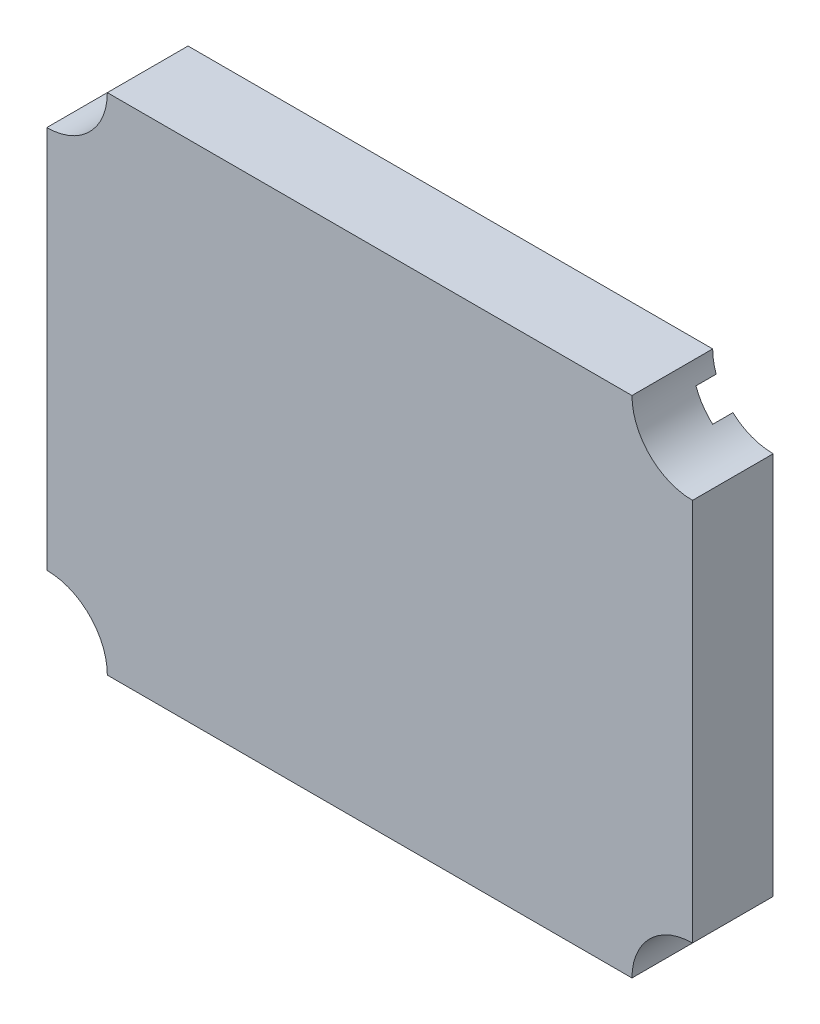
ISO-10303-21;
HEADER;
FILE_DESCRIPTION(('STEP AP214'),'2;1');
FILE_NAME('part.step','',(''),(''),'','','');
FILE_SCHEMA(('AUTOMOTIVE_DESIGN { 1 0 10303 214 1 1 1 1 }'));
ENDSEC;
DATA;
#1=APPLICATION_CONTEXT('core data for automotive mechanical design processes');
#2=APPLICATION_PROTOCOL_DEFINITION('international standard','automotive_design',2000,#1);
#3=PRODUCT_CONTEXT('',#1,'mechanical');
#4=PRODUCT('Part','Part','',(#3));
#5=PRODUCT_RELATED_PRODUCT_CATEGORY('part','',(#4));
#6=PRODUCT_DEFINITION_FORMATION('','',#4);
#7=PRODUCT_DEFINITION_CONTEXT('part definition',#1,'design');
#8=PRODUCT_DEFINITION('design','',#6,#7);
#9=PRODUCT_DEFINITION_SHAPE('','',#8);
#10=(LENGTH_UNIT() NAMED_UNIT(*) SI_UNIT(.MILLI.,.METRE.));
#11=(NAMED_UNIT(*) PLANE_ANGLE_UNIT() SI_UNIT($,.RADIAN.));
#12=(NAMED_UNIT(*) SI_UNIT($,.STERADIAN.) SOLID_ANGLE_UNIT());
#13=UNCERTAINTY_MEASURE_WITH_UNIT(LENGTH_MEASURE(1.E-05),#10,'distance_accuracy_value','');
#14=(GEOMETRIC_REPRESENTATION_CONTEXT(3) GLOBAL_UNCERTAINTY_ASSIGNED_CONTEXT((#13)) GLOBAL_UNIT_ASSIGNED_CONTEXT((#10,
#11,#12)) REPRESENTATION_CONTEXT('',''));
#15=CARTESIAN_POINT('',(0.,0.,0.));
#16=DIRECTION('',(0.,0.,1.));
#17=DIRECTION('',(1.,0.,0.));
#18=AXIS2_PLACEMENT_3D('',#15,#16,#17);
#19=CARTESIAN_POINT('',(0.,0.,0.4));
#20=DIRECTION('',(0.,0.,1.));
#21=DIRECTION('',(1.,0.,0.));
#22=AXIS2_PLACEMENT_3D('',#19,#20,#21);
#23=PLANE('',#22);
#24=CARTESIAN_POINT('',(-1.6,-1.25,0.4));
#25=DIRECTION('',(0.,0.,-1.));
#26=DIRECTION('',(1.,0.,0.));
#27=AXIS2_PLACEMENT_3D('',#24,#25,#26);
#28=CIRCLE('',#27,0.3);
#29=CARTESIAN_POINT('',(-1.6,-0.95,0.4));
#30=VERTEX_POINT('',#29);
#31=CARTESIAN_POINT('',(-1.3,-1.25,0.4));
#32=VERTEX_POINT('',#31);
#33=EDGE_CURVE('E278',#30,#32,#28,.T.);
#34=ORIENTED_EDGE('',*,*,#33,.T.);
#35=DIRECTION('',(1.,0.,0.));
#36=VECTOR('',#35,1.);
#37=CARTESIAN_POINT('',(1.6,-1.25,0.4));
#38=LINE('',#37,#36);
#39=CARTESIAN_POINT('',(1.3,-1.25,0.4));
#40=VERTEX_POINT('',#39);
#41=EDGE_CURVE('E11',#32,#40,#38,.T.);
#42=ORIENTED_EDGE('',*,*,#41,.T.);
#43=CARTESIAN_POINT('',(1.6,-1.25,0.4));
#44=DIRECTION('',(0.,0.,-1.));
#45=DIRECTION('',(1.,0.,0.));
#46=AXIS2_PLACEMENT_3D('',#43,#44,#45);
#47=CIRCLE('',#46,0.3);
#48=CARTESIAN_POINT('',(1.6,-0.95,0.4));
#49=VERTEX_POINT('',#48);
#50=EDGE_CURVE('E387',#40,#49,#47,.T.);
#51=ORIENTED_EDGE('',*,*,#50,.T.);
#52=DIRECTION('',(0.,1.,0.));
#53=VECTOR('',#52,1.);
#54=CARTESIAN_POINT('',(1.6,1.25,0.4));
#55=LINE('',#54,#53);
#56=CARTESIAN_POINT('',(1.6,0.95,0.4));
#57=VERTEX_POINT('',#56);
#58=EDGE_CURVE('E27',#49,#57,#55,.T.);
#59=ORIENTED_EDGE('',*,*,#58,.T.);
#60=CARTESIAN_POINT('',(1.6,1.25,0.4));
#61=DIRECTION('',(0.,0.,-1.));
#62=DIRECTION('',(1.,0.,0.));
#63=AXIS2_PLACEMENT_3D('',#60,#61,#62);
#64=CIRCLE('',#63,0.3);
#65=CARTESIAN_POINT('',(1.3,1.25,0.4));
#66=VERTEX_POINT('',#65);
#67=EDGE_CURVE('E183',#57,#66,#64,.T.);
#68=ORIENTED_EDGE('',*,*,#67,.T.);
#69=DIRECTION('',(-1.,0.,0.));
#70=VECTOR('',#69,1.);
#71=CARTESIAN_POINT('',(-1.6,1.25,0.4));
#72=LINE('',#71,#70);
#73=CARTESIAN_POINT('',(-1.3,1.25,0.4));
#74=VERTEX_POINT('',#73);
#75=EDGE_CURVE('E41',#66,#74,#72,.T.);
#76=ORIENTED_EDGE('',*,*,#75,.T.);
#77=CARTESIAN_POINT('',(-1.6,1.25,0.4));
#78=DIRECTION('',(0.,0.,-1.));
#79=DIRECTION('',(1.,0.,0.));
#80=AXIS2_PLACEMENT_3D('',#77,#78,#79);
#81=CIRCLE('',#80,0.3);
#82=CARTESIAN_POINT('',(-1.6,0.95,0.4));
#83=VERTEX_POINT('',#82);
#84=EDGE_CURVE('E411',#74,#83,#81,.T.);
#85=ORIENTED_EDGE('',*,*,#84,.T.);
#86=DIRECTION('',(0.,-1.,0.));
#87=VECTOR('',#86,1.);
#88=CARTESIAN_POINT('',(-1.6,-1.25,0.4));
#89=LINE('',#88,#87);
#90=EDGE_CURVE('E469',#83,#30,#89,.T.);
#91=ORIENTED_EDGE('',*,*,#90,.T.);
#92=EDGE_LOOP('',(#34,#42,#51,#59,#68,#76,#85,#91));
#93=FACE_BOUND('',#92,.T.);
#94=ADVANCED_FACE('F16',(#93),#23,.T.);
#95=CARTESIAN_POINT('',(-1.3,-1.25,0.));
#96=DIRECTION('',(0.,-1.,0.));
#97=DIRECTION('',(0.,0.,-1.));
#98=AXIS2_PLACEMENT_3D('',#95,#96,#97);
#99=PLANE('',#98);
#100=DIRECTION('',(-1.,0.,0.));
#101=VECTOR('',#100,1.);
#102=CARTESIAN_POINT('',(1.6,-1.25,0.));
#103=LINE('',#102,#101);
#104=CARTESIAN_POINT('',(1.3,-1.25,0.));
#105=VERTEX_POINT('',#104);
#106=CARTESIAN_POINT('',(-1.3,-1.25,0.));
#107=VERTEX_POINT('',#106);
#108=EDGE_CURVE('E297',#105,#107,#103,.T.);
#109=ORIENTED_EDGE('',*,*,#108,.F.);
#110=DIRECTION('',(0.,0.,1.));
#111=VECTOR('',#110,1.);
#112=CARTESIAN_POINT('',(1.3,-1.25,0.));
#113=LINE('',#112,#111);
#114=EDGE_CURVE('E390',#105,#40,#113,.T.);
#115=ORIENTED_EDGE('',*,*,#114,.T.);
#116=ORIENTED_EDGE('',*,*,#41,.F.);
#117=DIRECTION('',(0.,0.,1.));
#118=VECTOR('',#117,1.);
#119=CARTESIAN_POINT('',(-1.3,-1.25,0.));
#120=LINE('',#119,#118);
#121=EDGE_CURVE('E292',#107,#32,#120,.T.);
#122=ORIENTED_EDGE('',*,*,#121,.F.);
#123=EDGE_LOOP('',(#109,#115,#116,#122));
#124=FACE_BOUND('',#123,.T.);
#125=ADVANCED_FACE('F678',(#124),#99,.T.);
#126=CARTESIAN_POINT('',(1.6,-0.95,0.));
#127=DIRECTION('',(1.,0.,0.));
#128=DIRECTION('',(0.,1.,0.));
#129=AXIS2_PLACEMENT_3D('',#126,#127,#128);
#130=PLANE('',#129);
#131=DIRECTION('',(0.,-1.,0.));
#132=VECTOR('',#131,1.);
#133=CARTESIAN_POINT('',(1.6,1.25,0.));
#134=LINE('',#133,#132);
#135=CARTESIAN_POINT('',(1.6,0.95,0.));
#136=VERTEX_POINT('',#135);
#137=CARTESIAN_POINT('',(1.6,-0.95,0.));
#138=VERTEX_POINT('',#137);
#139=EDGE_CURVE('E225',#136,#138,#134,.T.);
#140=ORIENTED_EDGE('',*,*,#139,.F.);
#141=DIRECTION('',(0.,0.,1.));
#142=VECTOR('',#141,1.);
#143=CARTESIAN_POINT('',(1.6,0.95,0.));
#144=LINE('',#143,#142);
#145=EDGE_CURVE('E255',#136,#57,#144,.T.);
#146=ORIENTED_EDGE('',*,*,#145,.T.);
#147=ORIENTED_EDGE('',*,*,#58,.F.);
#148=DIRECTION('',(0.,0.,1.));
#149=VECTOR('',#148,1.);
#150=CARTESIAN_POINT('',(1.6,-0.95,0.));
#151=LINE('',#150,#149);
#152=EDGE_CURVE('E391',#138,#49,#151,.T.);
#153=ORIENTED_EDGE('',*,*,#152,.F.);
#154=EDGE_LOOP('',(#140,#146,#147,#153));
#155=FACE_BOUND('',#154,.T.);
#156=ADVANCED_FACE('F673',(#155),#130,.T.);
#157=CARTESIAN_POINT('',(1.3,1.25,0.));
#158=DIRECTION('',(0.,1.,0.));
#159=DIRECTION('',(1.,0.,0.));
#160=AXIS2_PLACEMENT_3D('',#157,#158,#159);
#161=PLANE('',#160);
#162=DIRECTION('',(1.,0.,0.));
#163=VECTOR('',#162,1.);
#164=CARTESIAN_POINT('',(-1.6,1.25,0.));
#165=LINE('',#164,#163);
#166=CARTESIAN_POINT('',(-1.3,1.25,0.));
#167=VERTEX_POINT('',#166);
#168=CARTESIAN_POINT('',(1.3,1.25,0.));
#169=VERTEX_POINT('',#168);
#170=EDGE_CURVE('E177',#167,#169,#165,.T.);
#171=ORIENTED_EDGE('',*,*,#170,.F.);
#172=DIRECTION('',(0.,0.,1.));
#173=VECTOR('',#172,1.);
#174=CARTESIAN_POINT('',(-1.3,1.25,0.));
#175=LINE('',#174,#173);
#176=EDGE_CURVE('E414',#167,#74,#175,.T.);
#177=ORIENTED_EDGE('',*,*,#176,.T.);
#178=ORIENTED_EDGE('',*,*,#75,.F.);
#179=DIRECTION('',(0.,0.,1.));
#180=VECTOR('',#179,1.);
#181=CARTESIAN_POINT('',(1.3,1.25,0.));
#182=LINE('',#181,#180);
#183=EDGE_CURVE('E173',#169,#66,#182,.T.);
#184=ORIENTED_EDGE('',*,*,#183,.F.);
#185=EDGE_LOOP('',(#171,#177,#178,#184));
#186=FACE_BOUND('',#185,.T.);
#187=ADVANCED_FACE('F175',(#186),#161,.T.);
#188=CARTESIAN_POINT('',(-1.6,0.95,0.));
#189=DIRECTION('',(-1.,0.,0.));
#190=DIRECTION('',(0.,0.,1.));
#191=AXIS2_PLACEMENT_3D('',#188,#189,#190);
#192=PLANE('',#191);
#193=DIRECTION('',(0.,1.,0.));
#194=VECTOR('',#193,1.);
#195=CARTESIAN_POINT('',(-1.6,-1.25,0.));
#196=LINE('',#195,#194);
#197=CARTESIAN_POINT('',(-1.6,-0.95,0.));
#198=VERTEX_POINT('',#197);
#199=CARTESIAN_POINT('',(-1.6,0.95,0.));
#200=VERTEX_POINT('',#199);
#201=EDGE_CURVE('E20',#198,#200,#196,.T.);
#202=ORIENTED_EDGE('',*,*,#201,.F.);
#203=DIRECTION('',(0.,0.,1.));
#204=VECTOR('',#203,1.);
#205=CARTESIAN_POINT('',(-1.6,-0.95,0.));
#206=LINE('',#205,#204);
#207=EDGE_CURVE('E274',#198,#30,#206,.T.);
#208=ORIENTED_EDGE('',*,*,#207,.T.);
#209=ORIENTED_EDGE('',*,*,#90,.F.);
#210=DIRECTION('',(0.,0.,1.));
#211=VECTOR('',#210,1.);
#212=CARTESIAN_POINT('',(-1.6,0.95,0.));
#213=LINE('',#212,#211);
#214=EDGE_CURVE('E251',#200,#83,#213,.T.);
#215=ORIENTED_EDGE('',*,*,#214,.F.);
#216=EDGE_LOOP('',(#202,#208,#209,#215));
#217=FACE_BOUND('',#216,.T.);
#218=ADVANCED_FACE('F728',(#217),#192,.T.);
#219=CARTESIAN_POINT('',(-1.6,1.25,0.));
#220=DIRECTION('',(0.,0.,1.));
#221=DIRECTION('',(1.,0.,0.));
#222=AXIS2_PLACEMENT_3D('',#219,#220,#221);
#223=CYLINDRICAL_SURFACE('',#222,0.3);
#224=ORIENTED_EDGE('',*,*,#214,.T.);
#225=ORIENTED_EDGE('',*,*,#84,.F.);
#226=ORIENTED_EDGE('',*,*,#176,.F.);
#227=CARTESIAN_POINT('',(-1.6,1.25,0.));
#228=DIRECTION('',(0.,0.,1.));
#229=DIRECTION('',(1.,0.,0.));
#230=AXIS2_PLACEMENT_3D('',#227,#228,#229);
#231=CIRCLE('',#230,0.3);
#232=CARTESIAN_POINT('',(-1.31715728752538,1.15,0.));
#233=VERTEX_POINT('',#232);
#234=EDGE_CURVE('E202',#233,#167,#231,.T.);
#235=ORIENTED_EDGE('',*,*,#234,.F.);
#236=DIRECTION('',(0.,0.,1.));
#237=VECTOR('',#236,1.);
#238=CARTESIAN_POINT('',(-1.31715728752538,1.15,0.));
#239=LINE('',#238,#237);
#240=CARTESIAN_POINT('',(-1.31715728752538,1.15,0.1));
#241=VERTEX_POINT('',#240);
#242=EDGE_CURVE('E240',#233,#241,#239,.T.);
#243=ORIENTED_EDGE('',*,*,#242,.T.);
#244=CARTESIAN_POINT('',(-1.6,1.25,0.1));
#245=DIRECTION('',(0.,0.,-1.));
#246=DIRECTION('',(1.,0.,0.));
#247=AXIS2_PLACEMENT_3D('',#244,#245,#246);
#248=CIRCLE('',#247,0.3);
#249=CARTESIAN_POINT('',(-1.4,1.02639320225002,0.1));
#250=VERTEX_POINT('',#249);
#251=EDGE_CURVE('E247',#241,#250,#248,.T.);
#252=ORIENTED_EDGE('',*,*,#251,.T.);
#253=DIRECTION('',(0.,0.,-1.));
#254=VECTOR('',#253,1.);
#255=CARTESIAN_POINT('',(-1.4,1.02639320225002,0.));
#256=LINE('',#255,#254);
#257=CARTESIAN_POINT('',(-1.4,1.02639320225002,0.));
#258=VERTEX_POINT('',#257);
#259=EDGE_CURVE('E236',#250,#258,#256,.T.);
#260=ORIENTED_EDGE('',*,*,#259,.T.);
#261=CARTESIAN_POINT('',(-1.6,1.25,0.));
#262=DIRECTION('',(0.,0.,1.));
#263=DIRECTION('',(1.,0.,0.));
#264=AXIS2_PLACEMENT_3D('',#261,#262,#263);
#265=CIRCLE('',#264,0.3);
#266=EDGE_CURVE('E316',#200,#258,#265,.T.);
#267=ORIENTED_EDGE('',*,*,#266,.F.);
#268=EDGE_LOOP('',(#224,#225,#226,#235,#243,#252,#260,#267));
#269=FACE_BOUND('',#268,.T.);
#270=ADVANCED_FACE('F666',(#269),#223,.F.);
#271=CARTESIAN_POINT('',(-0.9,0.73125,0.1));
#272=DIRECTION('',(0.,0.,1.));
#273=DIRECTION('',(1.,0.,0.));
#274=AXIS2_PLACEMENT_3D('',#271,#272,#273);
#275=PLANE('',#274);
#276=DIRECTION('',(-1.,0.,0.));
#277=VECTOR('',#276,1.);
#278=CARTESIAN_POINT('',(-0.4,1.15,0.1));
#279=LINE('',#278,#277);
#280=CARTESIAN_POINT('',(-0.4,1.15,0.1));
#281=VERTEX_POINT('',#280);
#282=EDGE_CURVE('E235',#281,#241,#279,.T.);
#283=ORIENTED_EDGE('',*,*,#282,.F.);
#284=DIRECTION('',(0.,1.,0.));
#285=VECTOR('',#284,1.);
#286=CARTESIAN_POINT('',(-0.4,0.3125,0.1));
#287=LINE('',#286,#285);
#288=CARTESIAN_POINT('',(-0.4,0.3125,0.1));
#289=VERTEX_POINT('',#288);
#290=EDGE_CURVE('E306',#289,#281,#287,.T.);
#291=ORIENTED_EDGE('',*,*,#290,.F.);
#292=DIRECTION('',(1.,0.,0.));
#293=VECTOR('',#292,1.);
#294=CARTESIAN_POINT('',(-0.4,0.3125,0.1));
#295=LINE('',#294,#293);
#296=CARTESIAN_POINT('',(-1.4,0.3125,0.1));
#297=VERTEX_POINT('',#296);
#298=EDGE_CURVE('E315',#297,#289,#295,.T.);
#299=ORIENTED_EDGE('',*,*,#298,.F.);
#300=DIRECTION('',(0.,-1.,0.));
#301=VECTOR('',#300,1.);
#302=CARTESIAN_POINT('',(-1.4,0.3125,0.1));
#303=LINE('',#302,#301);
#304=EDGE_CURVE('E231',#250,#297,#303,.T.);
#305=ORIENTED_EDGE('',*,*,#304,.F.);
#306=ORIENTED_EDGE('',*,*,#251,.F.);
#307=EDGE_LOOP('',(#283,#291,#299,#305,#306));
#308=FACE_BOUND('',#307,.T.);
#309=ADVANCED_FACE('F661',(#308),#275,.F.);
#310=CARTESIAN_POINT('',(-0.4,1.15,0.));
#311=DIRECTION('',(0.,1.,0.));
#312=DIRECTION('',(1.,0.,0.));
#313=AXIS2_PLACEMENT_3D('',#310,#311,#312);
#314=PLANE('',#313);
#315=DIRECTION('',(-1.,0.,0.));
#316=VECTOR('',#315,1.);
#317=CARTESIAN_POINT('',(-0.2,1.15,0.));
#318=LINE('',#317,#316);
#319=CARTESIAN_POINT('',(-0.4,1.15,0.));
#320=VERTEX_POINT('',#319);
#321=EDGE_CURVE('E209',#320,#233,#318,.T.);
#322=ORIENTED_EDGE('',*,*,#321,.F.);
#323=DIRECTION('',(0.,0.,1.));
#324=VECTOR('',#323,1.);
#325=CARTESIAN_POINT('',(-0.4,1.15,0.));
#326=LINE('',#325,#324);
#327=EDGE_CURVE('E310',#320,#281,#326,.T.);
#328=ORIENTED_EDGE('',*,*,#327,.T.);
#329=ORIENTED_EDGE('',*,*,#282,.T.);
#330=ORIENTED_EDGE('',*,*,#242,.F.);
#331=EDGE_LOOP('',(#322,#328,#329,#330));
#332=FACE_BOUND('',#331,.T.);
#333=ADVANCED_FACE('F18',(#332),#314,.F.);
#334=CARTESIAN_POINT('',(-1.4,1.02639320225002,0.));
#335=DIRECTION('',(-1.,0.,0.));
#336=DIRECTION('',(0.,0.,1.));
#337=AXIS2_PLACEMENT_3D('',#334,#335,#336);
#338=PLANE('',#337);
#339=DIRECTION('',(0.,-1.,0.));
#340=VECTOR('',#339,1.);
#341=CARTESIAN_POINT('',(-1.4,0.513196601125011,0.));
#342=LINE('',#341,#340);
#343=CARTESIAN_POINT('',(-1.4,0.3125,0.));
#344=VERTEX_POINT('',#343);
#345=EDGE_CURVE('E320',#258,#344,#342,.T.);
#346=ORIENTED_EDGE('',*,*,#345,.F.);
#347=ORIENTED_EDGE('',*,*,#259,.F.);
#348=ORIENTED_EDGE('',*,*,#304,.T.);
#349=DIRECTION('',(0.,0.,1.));
#350=VECTOR('',#349,1.);
#351=CARTESIAN_POINT('',(-1.4,0.3125,0.));
#352=LINE('',#351,#350);
#353=EDGE_CURVE('E311',#344,#297,#352,.T.);
#354=ORIENTED_EDGE('',*,*,#353,.F.);
#355=EDGE_LOOP('',(#346,#347,#348,#354));
#356=FACE_BOUND('',#355,.T.);
#357=ADVANCED_FACE('F740',(#356),#338,.F.);
#358=CARTESIAN_POINT('',(-1.4,0.3125,0.));
#359=DIRECTION('',(0.,-1.,0.));
#360=DIRECTION('',(0.,0.,-1.));
#361=AXIS2_PLACEMENT_3D('',#358,#359,#360);
#362=PLANE('',#361);
#363=DIRECTION('',(1.,0.,0.));
#364=VECTOR('',#363,1.);
#365=CARTESIAN_POINT('',(-0.7,0.3125,0.));
#366=LINE('',#365,#364);
#367=CARTESIAN_POINT('',(-0.4,0.3125,0.));
#368=VERTEX_POINT('',#367);
#369=EDGE_CURVE('E329',#344,#368,#366,.T.);
#370=ORIENTED_EDGE('',*,*,#369,.F.);
#371=ORIENTED_EDGE('',*,*,#353,.T.);
#372=ORIENTED_EDGE('',*,*,#298,.T.);
#373=DIRECTION('',(0.,0.,1.));
#374=VECTOR('',#373,1.);
#375=CARTESIAN_POINT('',(-0.4,0.3125,0.));
#376=LINE('',#375,#374);
#377=EDGE_CURVE('E259',#368,#289,#376,.T.);
#378=ORIENTED_EDGE('',*,*,#377,.F.);
#379=EDGE_LOOP('',(#370,#371,#372,#378));
#380=FACE_BOUND('',#379,.T.);
#381=ADVANCED_FACE('F745',(#380),#362,.F.);
#382=CARTESIAN_POINT('',(-0.4,0.3125,0.));
#383=DIRECTION('',(1.,0.,0.));
#384=DIRECTION('',(0.,1.,0.));
#385=AXIS2_PLACEMENT_3D('',#382,#383,#384);
#386=PLANE('',#385);
#387=DIRECTION('',(0.,1.,0.));
#388=VECTOR('',#387,1.);
#389=CARTESIAN_POINT('',(-0.4,0.15625,0.));
#390=LINE('',#389,#388);
#391=EDGE_CURVE('E449',#368,#320,#390,.T.);
#392=ORIENTED_EDGE('',*,*,#391,.F.);
#393=ORIENTED_EDGE('',*,*,#377,.T.);
#394=ORIENTED_EDGE('',*,*,#290,.T.);
#395=ORIENTED_EDGE('',*,*,#327,.F.);
#396=EDGE_LOOP('',(#392,#393,#394,#395));
#397=FACE_BOUND('',#396,.T.);
#398=ADVANCED_FACE('F766',(#397),#386,.F.);
#399=CARTESIAN_POINT('',(1.6,1.25,0.));
#400=DIRECTION('',(0.,0.,1.));
#401=DIRECTION('',(1.,0.,0.));
#402=AXIS2_PLACEMENT_3D('',#399,#400,#401);
#403=CYLINDRICAL_SURFACE('',#402,0.3);
#404=ORIENTED_EDGE('',*,*,#183,.T.);
#405=ORIENTED_EDGE('',*,*,#67,.F.);
#406=ORIENTED_EDGE('',*,*,#145,.F.);
#407=CARTESIAN_POINT('',(1.6,1.25,0.));
#408=DIRECTION('',(0.,0.,1.));
#409=DIRECTION('',(1.,0.,0.));
#410=AXIS2_PLACEMENT_3D('',#407,#408,#409);
#411=CIRCLE('',#410,0.3);
#412=CARTESIAN_POINT('',(1.4,1.02639320225002,0.));
#413=VERTEX_POINT('',#412);
#414=EDGE_CURVE('E221',#413,#136,#411,.T.);
#415=ORIENTED_EDGE('',*,*,#414,.F.);
#416=DIRECTION('',(0.,0.,1.));
#417=VECTOR('',#416,1.);
#418=CARTESIAN_POINT('',(1.4,1.02639320225002,0.));
#419=LINE('',#418,#417);
#420=CARTESIAN_POINT('',(1.4,1.02639320225002,0.1));
#421=VERTEX_POINT('',#420);
#422=EDGE_CURVE('E288',#413,#421,#419,.T.);
#423=ORIENTED_EDGE('',*,*,#422,.T.);
#424=CARTESIAN_POINT('',(1.6,1.25,0.1));
#425=DIRECTION('',(0.,0.,-1.));
#426=DIRECTION('',(1.,0.,0.));
#427=AXIS2_PLACEMENT_3D('',#424,#425,#426);
#428=CIRCLE('',#427,0.3);
#429=CARTESIAN_POINT('',(1.31715728752538,1.15,0.1));
#430=VERTEX_POINT('',#429);
#431=EDGE_CURVE('E184',#421,#430,#428,.T.);
#432=ORIENTED_EDGE('',*,*,#431,.T.);
#433=DIRECTION('',(0.,0.,-1.));
#434=VECTOR('',#433,1.);
#435=CARTESIAN_POINT('',(1.31715728752538,1.15,0.));
#436=LINE('',#435,#434);
#437=CARTESIAN_POINT('',(1.31715728752538,1.15,0.));
#438=VERTEX_POINT('',#437);
#439=EDGE_CURVE('E191',#430,#438,#436,.T.);
#440=ORIENTED_EDGE('',*,*,#439,.T.);
#441=CARTESIAN_POINT('',(1.6,1.25,0.));
#442=DIRECTION('',(0.,0.,1.));
#443=DIRECTION('',(1.,0.,0.));
#444=AXIS2_PLACEMENT_3D('',#441,#442,#443);
#445=CIRCLE('',#444,0.3);
#446=EDGE_CURVE('E187',#169,#438,#445,.T.);
#447=ORIENTED_EDGE('',*,*,#446,.F.);
#448=EDGE_LOOP('',(#404,#405,#406,#415,#423,#432,#440,#447));
#449=FACE_BOUND('',#448,.T.);
#450=ADVANCED_FACE('F188',(#449),#403,.F.);
#451=CARTESIAN_POINT('',(0.9,0.73125,0.1));
#452=DIRECTION('',(0.,0.,1.));
#453=DIRECTION('',(1.,0.,0.));
#454=AXIS2_PLACEMENT_3D('',#451,#452,#453);
#455=PLANE('',#454);
#456=DIRECTION('',(1.,0.,0.));
#457=VECTOR('',#456,1.);
#458=CARTESIAN_POINT('',(0.4,0.3125,0.1));
#459=LINE('',#458,#457);
#460=CARTESIAN_POINT('',(0.4,0.3125,0.1));
#461=VERTEX_POINT('',#460);
#462=CARTESIAN_POINT('',(1.4,0.3125,0.1));
#463=VERTEX_POINT('',#462);
#464=EDGE_CURVE('E284',#461,#463,#459,.T.);
#465=ORIENTED_EDGE('',*,*,#464,.F.);
#466=DIRECTION('',(0.,-1.,0.));
#467=VECTOR('',#466,1.);
#468=CARTESIAN_POINT('',(0.4,0.3125,0.1));
#469=LINE('',#468,#467);
#470=CARTESIAN_POINT('',(0.4,1.15,0.1));
#471=VERTEX_POINT('',#470);
#472=EDGE_CURVE('E266',#471,#461,#469,.T.);
#473=ORIENTED_EDGE('',*,*,#472,.F.);
#474=DIRECTION('',(-1.,0.,0.));
#475=VECTOR('',#474,1.);
#476=CARTESIAN_POINT('',(0.4,1.15,0.1));
#477=LINE('',#476,#475);
#478=EDGE_CURVE('E465',#430,#471,#477,.T.);
#479=ORIENTED_EDGE('',*,*,#478,.F.);
#480=ORIENTED_EDGE('',*,*,#431,.F.);
#481=DIRECTION('',(0.,1.,0.));
#482=VECTOR('',#481,1.);
#483=CARTESIAN_POINT('',(1.4,0.3125,0.1));
#484=LINE('',#483,#482);
#485=EDGE_CURVE('E321',#463,#421,#484,.T.);
#486=ORIENTED_EDGE('',*,*,#485,.F.);
#487=EDGE_LOOP('',(#465,#473,#479,#480,#486));
#488=FACE_BOUND('',#487,.T.);
#489=ADVANCED_FACE('F788',(#488),#455,.F.);
#490=CARTESIAN_POINT('',(0.4,0.3125,0.));
#491=DIRECTION('',(0.,-1.,0.));
#492=DIRECTION('',(0.,0.,-1.));
#493=AXIS2_PLACEMENT_3D('',#490,#491,#492);
#494=PLANE('',#493);
#495=DIRECTION('',(1.,0.,0.));
#496=VECTOR('',#495,1.);
#497=CARTESIAN_POINT('',(0.2,0.3125,0.));
#498=LINE('',#497,#496);
#499=CARTESIAN_POINT('',(0.4,0.3125,0.));
#500=VERTEX_POINT('',#499);
#501=CARTESIAN_POINT('',(1.4,0.3125,0.));
#502=VERTEX_POINT('',#501);
#503=EDGE_CURVE('E230',#500,#502,#498,.T.);
#504=ORIENTED_EDGE('',*,*,#503,.F.);
#505=DIRECTION('',(0.,0.,1.));
#506=VECTOR('',#505,1.);
#507=CARTESIAN_POINT('',(0.4,0.3125,0.));
#508=LINE('',#507,#506);
#509=EDGE_CURVE('E270',#500,#461,#508,.T.);
#510=ORIENTED_EDGE('',*,*,#509,.T.);
#511=ORIENTED_EDGE('',*,*,#464,.T.);
#512=DIRECTION('',(0.,0.,1.));
#513=VECTOR('',#512,1.);
#514=CARTESIAN_POINT('',(1.4,0.3125,0.));
#515=LINE('',#514,#513);
#516=EDGE_CURVE('E325',#502,#463,#515,.T.);
#517=ORIENTED_EDGE('',*,*,#516,.F.);
#518=EDGE_LOOP('',(#504,#510,#511,#517));
#519=FACE_BOUND('',#518,.T.);
#520=ADVANCED_FACE('F782',(#519),#494,.F.);
#521=CARTESIAN_POINT('',(1.4,0.3125,0.));
#522=DIRECTION('',(1.,0.,0.));
#523=DIRECTION('',(0.,1.,0.));
#524=AXIS2_PLACEMENT_3D('',#521,#522,#523);
#525=PLANE('',#524);
#526=DIRECTION('',(0.,1.,0.));
#527=VECTOR('',#526,1.);
#528=CARTESIAN_POINT('',(1.4,0.15625,0.));
#529=LINE('',#528,#527);
#530=EDGE_CURVE('E226',#502,#413,#529,.T.);
#531=ORIENTED_EDGE('',*,*,#530,.F.);
#532=ORIENTED_EDGE('',*,*,#516,.T.);
#533=ORIENTED_EDGE('',*,*,#485,.T.);
#534=ORIENTED_EDGE('',*,*,#422,.F.);
#535=EDGE_LOOP('',(#531,#532,#533,#534));
#536=FACE_BOUND('',#535,.T.);
#537=ADVANCED_FACE('F787',(#536),#525,.F.);
#538=CARTESIAN_POINT('',(1.31715728752538,1.15,0.));
#539=DIRECTION('',(0.,1.,0.));
#540=DIRECTION('',(1.,0.,0.));
#541=AXIS2_PLACEMENT_3D('',#538,#539,#540);
#542=PLANE('',#541);
#543=DIRECTION('',(-1.,0.,0.));
#544=VECTOR('',#543,1.);
#545=CARTESIAN_POINT('',(0.658578643762691,1.15,0.));
#546=LINE('',#545,#544);
#547=CARTESIAN_POINT('',(0.4,1.15,0.));
#548=VERTEX_POINT('',#547);
#549=EDGE_CURVE('E196',#438,#548,#546,.T.);
#550=ORIENTED_EDGE('',*,*,#549,.F.);
#551=ORIENTED_EDGE('',*,*,#439,.F.);
#552=ORIENTED_EDGE('',*,*,#478,.T.);
#553=DIRECTION('',(0.,0.,1.));
#554=VECTOR('',#553,1.);
#555=CARTESIAN_POINT('',(0.4,1.15,0.));
#556=LINE('',#555,#554);
#557=EDGE_CURVE('E271',#548,#471,#556,.T.);
#558=ORIENTED_EDGE('',*,*,#557,.F.);
#559=EDGE_LOOP('',(#550,#551,#552,#558));
#560=FACE_BOUND('',#559,.T.);
#561=ADVANCED_FACE('F754',(#560),#542,.F.);
#562=CARTESIAN_POINT('',(0.4,1.15,0.));
#563=DIRECTION('',(-1.,0.,0.));
#564=DIRECTION('',(0.,0.,1.));
#565=AXIS2_PLACEMENT_3D('',#562,#563,#564);
#566=PLANE('',#565);
#567=DIRECTION('',(0.,-1.,0.));
#568=VECTOR('',#567,1.);
#569=CARTESIAN_POINT('',(0.4,0.575,0.));
#570=LINE('',#569,#568);
#571=EDGE_CURVE('E298',#548,#500,#570,.T.);
#572=ORIENTED_EDGE('',*,*,#571,.F.);
#573=ORIENTED_EDGE('',*,*,#557,.T.);
#574=ORIENTED_EDGE('',*,*,#472,.T.);
#575=ORIENTED_EDGE('',*,*,#509,.F.);
#576=EDGE_LOOP('',(#572,#573,#574,#575));
#577=FACE_BOUND('',#576,.T.);
#578=ADVANCED_FACE('F688',(#577),#566,.F.);
#579=CARTESIAN_POINT('',(1.6,-1.25,0.));
#580=DIRECTION('',(0.,0.,1.));
#581=DIRECTION('',(1.,0.,0.));
#582=AXIS2_PLACEMENT_3D('',#579,#580,#581);
#583=CYLINDRICAL_SURFACE('',#582,0.3);
#584=ORIENTED_EDGE('',*,*,#152,.T.);
#585=ORIENTED_EDGE('',*,*,#50,.F.);
#586=ORIENTED_EDGE('',*,*,#114,.F.);
#587=CARTESIAN_POINT('',(1.6,-1.25,0.));
#588=DIRECTION('',(0.,0.,1.));
#589=DIRECTION('',(1.,0.,0.));
#590=AXIS2_PLACEMENT_3D('',#587,#588,#589);
#591=CIRCLE('',#590,0.3);
#592=CARTESIAN_POINT('',(1.31715728752538,-1.15,0.));
#593=VERTEX_POINT('',#592);
#594=EDGE_CURVE('E293',#593,#105,#591,.T.);
#595=ORIENTED_EDGE('',*,*,#594,.F.);
#596=DIRECTION('',(0.,0.,1.));
#597=VECTOR('',#596,1.);
#598=CARTESIAN_POINT('',(1.31715728752538,-1.15,0.));
#599=LINE('',#598,#597);
#600=CARTESIAN_POINT('',(1.31715728752538,-1.15,0.1));
#601=VERTEX_POINT('',#600);
#602=EDGE_CURVE('E264',#593,#601,#599,.T.);
#603=ORIENTED_EDGE('',*,*,#602,.T.);
#604=CARTESIAN_POINT('',(1.6,-1.25,0.1));
#605=DIRECTION('',(0.,0.,-1.));
#606=DIRECTION('',(1.,0.,0.));
#607=AXIS2_PLACEMENT_3D('',#604,#605,#606);
#608=CIRCLE('',#607,0.3);
#609=CARTESIAN_POINT('',(1.4,-1.02639320225002,0.1));
#610=VERTEX_POINT('',#609);
#611=EDGE_CURVE('E386',#601,#610,#608,.T.);
#612=ORIENTED_EDGE('',*,*,#611,.T.);
#613=DIRECTION('',(0.,0.,-1.));
#614=VECTOR('',#613,1.);
#615=CARTESIAN_POINT('',(1.4,-1.02639320225002,0.));
#616=LINE('',#615,#614);
#617=CARTESIAN_POINT('',(1.4,-1.02639320225002,0.));
#618=VERTEX_POINT('',#617);
#619=EDGE_CURVE('E336',#610,#618,#616,.T.);
#620=ORIENTED_EDGE('',*,*,#619,.T.);
#621=CARTESIAN_POINT('',(1.6,-1.25,0.));
#622=DIRECTION('',(0.,0.,1.));
#623=DIRECTION('',(1.,0.,0.));
#624=AXIS2_PLACEMENT_3D('',#621,#622,#623);
#625=CIRCLE('',#624,0.3);
#626=EDGE_CURVE('E378',#138,#618,#625,.T.);
#627=ORIENTED_EDGE('',*,*,#626,.F.);
#628=EDGE_LOOP('',(#584,#585,#586,#595,#603,#612,#620,#627));
#629=FACE_BOUND('',#628,.T.);
#630=ADVANCED_FACE('F492',(#629),#583,.F.);
#631=CARTESIAN_POINT('',(0.9,-0.73125,0.1));
#632=DIRECTION('',(0.,0.,1.));
#633=DIRECTION('',(1.,0.,0.));
#634=AXIS2_PLACEMENT_3D('',#631,#632,#633);
#635=PLANE('',#634);
#636=DIRECTION('',(0.,-1.,0.));
#637=VECTOR('',#636,1.);
#638=CARTESIAN_POINT('',(0.4,-0.3125,0.1));
#639=LINE('',#638,#637);
#640=CARTESIAN_POINT('',(0.4,-0.3125,0.1));
#641=VERTEX_POINT('',#640);
#642=CARTESIAN_POINT('',(0.4,-1.15,0.1));
#643=VERTEX_POINT('',#642);
#644=EDGE_CURVE('E384',#641,#643,#639,.T.);
#645=ORIENTED_EDGE('',*,*,#644,.F.);
#646=DIRECTION('',(-1.,0.,0.));
#647=VECTOR('',#646,1.);
#648=CARTESIAN_POINT('',(0.4,-0.3125,0.1));
#649=LINE('',#648,#647);
#650=CARTESIAN_POINT('',(1.4,-0.3125,0.1));
#651=VERTEX_POINT('',#650);
#652=EDGE_CURVE('E357',#651,#641,#649,.T.);
#653=ORIENTED_EDGE('',*,*,#652,.F.);
#654=DIRECTION('',(0.,1.,0.));
#655=VECTOR('',#654,1.);
#656=CARTESIAN_POINT('',(1.4,-0.3125,0.1));
#657=LINE('',#656,#655);
#658=EDGE_CURVE('E333',#610,#651,#657,.T.);
#659=ORIENTED_EDGE('',*,*,#658,.F.);
#660=ORIENTED_EDGE('',*,*,#611,.F.);
#661=DIRECTION('',(1.,0.,0.));
#662=VECTOR('',#661,1.);
#663=CARTESIAN_POINT('',(0.4,-1.15,0.1));
#664=LINE('',#663,#662);
#665=EDGE_CURVE('E260',#643,#601,#664,.T.);
#666=ORIENTED_EDGE('',*,*,#665,.F.);
#667=EDGE_LOOP('',(#645,#653,#659,#660,#666));
#668=FACE_BOUND('',#667,.T.);
#669=ADVANCED_FACE('F574',(#668),#635,.F.);
#670=CARTESIAN_POINT('',(0.4,-0.3125,0.));
#671=DIRECTION('',(-1.,0.,0.));
#672=DIRECTION('',(0.,1.,0.));
#673=AXIS2_PLACEMENT_3D('',#670,#671,#672);
#674=PLANE('',#673);
#675=DIRECTION('',(0.,-1.,0.));
#676=VECTOR('',#675,1.);
#677=CARTESIAN_POINT('',(0.4,-0.15625,0.));
#678=LINE('',#677,#676);
#679=CARTESIAN_POINT('',(0.4,-0.3125,0.));
#680=VERTEX_POINT('',#679);
#681=CARTESIAN_POINT('',(0.4,-1.15,0.));
#682=VERTEX_POINT('',#681);
#683=EDGE_CURVE('E241',#680,#682,#678,.T.);
#684=ORIENTED_EDGE('',*,*,#683,.F.);
#685=DIRECTION('',(0.,0.,1.));
#686=VECTOR('',#685,1.);
#687=CARTESIAN_POINT('',(0.4,-0.3125,0.));
#688=LINE('',#687,#686);
#689=EDGE_CURVE('E353',#680,#641,#688,.T.);
#690=ORIENTED_EDGE('',*,*,#689,.T.);
#691=ORIENTED_EDGE('',*,*,#644,.T.);
#692=DIRECTION('',(0.,0.,1.));
#693=VECTOR('',#692,1.);
#694=CARTESIAN_POINT('',(0.4,-1.15,0.));
#695=LINE('',#694,#693);
#696=EDGE_CURVE('E265',#682,#643,#695,.T.);
#697=ORIENTED_EDGE('',*,*,#696,.F.);
#698=EDGE_LOOP('',(#684,#690,#691,#697));
#699=FACE_BOUND('',#698,.T.);
#700=ADVANCED_FACE('F582',(#699),#674,.F.);
#701=CARTESIAN_POINT('',(0.4,-1.15,0.));
#702=DIRECTION('',(0.,-1.,0.));
#703=DIRECTION('',(0.,0.,-1.));
#704=AXIS2_PLACEMENT_3D('',#701,#702,#703);
#705=PLANE('',#704);
#706=DIRECTION('',(1.,0.,0.));
#707=VECTOR('',#706,1.);
#708=CARTESIAN_POINT('',(0.2,-1.15,0.));
#709=LINE('',#708,#707);
#710=EDGE_CURVE('E245',#682,#593,#709,.T.);
#711=ORIENTED_EDGE('',*,*,#710,.F.);
#712=ORIENTED_EDGE('',*,*,#696,.T.);
#713=ORIENTED_EDGE('',*,*,#665,.T.);
#714=ORIENTED_EDGE('',*,*,#602,.F.);
#715=EDGE_LOOP('',(#711,#712,#713,#714));
#716=FACE_BOUND('',#715,.T.);
#717=ADVANCED_FACE('F579',(#716),#705,.F.);
#718=CARTESIAN_POINT('',(1.4,-1.02639320225002,0.));
#719=DIRECTION('',(1.,0.,0.));
#720=DIRECTION('',(0.,1.,0.));
#721=AXIS2_PLACEMENT_3D('',#718,#719,#720);
#722=PLANE('',#721);
#723=DIRECTION('',(0.,1.,0.));
#724=VECTOR('',#723,1.);
#725=CARTESIAN_POINT('',(1.4,-0.513196601125011,0.));
#726=LINE('',#725,#724);
#727=CARTESIAN_POINT('',(1.4,-0.3125,0.));
#728=VERTEX_POINT('',#727);
#729=EDGE_CURVE('E374',#618,#728,#726,.T.);
#730=ORIENTED_EDGE('',*,*,#729,.F.);
#731=ORIENTED_EDGE('',*,*,#619,.F.);
#732=ORIENTED_EDGE('',*,*,#658,.T.);
#733=DIRECTION('',(0.,0.,1.));
#734=VECTOR('',#733,1.);
#735=CARTESIAN_POINT('',(1.4,-0.3125,0.));
#736=LINE('',#735,#734);
#737=EDGE_CURVE('E213',#728,#651,#736,.T.);
#738=ORIENTED_EDGE('',*,*,#737,.F.);
#739=EDGE_LOOP('',(#730,#731,#732,#738));
#740=FACE_BOUND('',#739,.T.);
#741=ADVANCED_FACE('F812',(#740),#722,.F.);
#742=CARTESIAN_POINT('',(1.4,-0.3125,0.));
#743=DIRECTION('',(0.,1.,0.));
#744=DIRECTION('',(1.,0.,0.));
#745=AXIS2_PLACEMENT_3D('',#742,#743,#744);
#746=PLANE('',#745);
#747=DIRECTION('',(-1.,0.,0.));
#748=VECTOR('',#747,1.);
#749=CARTESIAN_POINT('',(0.7,-0.3125,0.));
#750=LINE('',#749,#748);
#751=EDGE_CURVE('E246',#728,#680,#750,.T.);
#752=ORIENTED_EDGE('',*,*,#751,.F.);
#753=ORIENTED_EDGE('',*,*,#737,.T.);
#754=ORIENTED_EDGE('',*,*,#652,.T.);
#755=ORIENTED_EDGE('',*,*,#689,.F.);
#756=EDGE_LOOP('',(#752,#753,#754,#755));
#757=FACE_BOUND('',#756,.T.);
#758=ADVANCED_FACE('F586',(#757),#746,.F.);
#759=CARTESIAN_POINT('',(-1.6,-1.25,0.));
#760=DIRECTION('',(0.,0.,1.));
#761=DIRECTION('',(1.,0.,0.));
#762=AXIS2_PLACEMENT_3D('',#759,#760,#761);
#763=CYLINDRICAL_SURFACE('',#762,0.3);
#764=ORIENTED_EDGE('',*,*,#121,.T.);
#765=ORIENTED_EDGE('',*,*,#33,.F.);
#766=ORIENTED_EDGE('',*,*,#207,.F.);
#767=CARTESIAN_POINT('',(-1.6,-1.25,0.));
#768=DIRECTION('',(0.,0.,1.));
#769=DIRECTION('',(1.,0.,0.));
#770=AXIS2_PLACEMENT_3D('',#767,#768,#769);
#771=CIRCLE('',#770,0.3);
#772=CARTESIAN_POINT('',(-1.4,-1.02639320225002,0.));
#773=VERTEX_POINT('',#772);
#774=EDGE_CURVE('E302',#773,#198,#771,.T.);
#775=ORIENTED_EDGE('',*,*,#774,.F.);
#776=DIRECTION('',(0.,0.,1.));
#777=VECTOR('',#776,1.);
#778=CARTESIAN_POINT('',(-1.4,-1.02639320225002,0.));
#779=LINE('',#778,#777);
#780=CARTESIAN_POINT('',(-1.4,-1.02639320225002,0.1));
#781=VERTEX_POINT('',#780);
#782=EDGE_CURVE('E352',#773,#781,#779,.T.);
#783=ORIENTED_EDGE('',*,*,#782,.T.);
#784=CARTESIAN_POINT('',(-1.6,-1.25,0.1));
#785=DIRECTION('',(0.,0.,-1.));
#786=DIRECTION('',(1.,0.,0.));
#787=AXIS2_PLACEMENT_3D('',#784,#785,#786);
#788=CIRCLE('',#787,0.3);
#789=CARTESIAN_POINT('',(-1.31715728752538,-1.15,0.1));
#790=VERTEX_POINT('',#789);
#791=EDGE_CURVE('E282',#781,#790,#788,.T.);
#792=ORIENTED_EDGE('',*,*,#791,.T.);
#793=DIRECTION('',(0.,0.,-1.));
#794=VECTOR('',#793,1.);
#795=CARTESIAN_POINT('',(-1.31715728752538,-1.15,0.));
#796=LINE('',#795,#794);
#797=CARTESIAN_POINT('',(-1.31715728752538,-1.15,0.));
#798=VERTEX_POINT('',#797);
#799=EDGE_CURVE('E373',#790,#798,#796,.T.);
#800=ORIENTED_EDGE('',*,*,#799,.T.);
#801=CARTESIAN_POINT('',(-1.6,-1.25,0.));
#802=DIRECTION('',(0.,0.,1.));
#803=DIRECTION('',(1.,0.,0.));
#804=AXIS2_PLACEMENT_3D('',#801,#802,#803);
#805=CIRCLE('',#804,0.3);
#806=EDGE_CURVE('E337',#107,#798,#805,.T.);
#807=ORIENTED_EDGE('',*,*,#806,.F.);
#808=EDGE_LOOP('',(#764,#765,#766,#775,#783,#792,#800,#807));
#809=FACE_BOUND('',#808,.T.);
#810=ADVANCED_FACE('F715',(#809),#763,.F.);
#811=CARTESIAN_POINT('',(0.,0.,0.));
#812=DIRECTION('',(0.,0.,1.));
#813=DIRECTION('',(1.,0.,0.));
#814=AXIS2_PLACEMENT_3D('',#811,#812,#813);
#815=PLANE('',#814);
#816=DIRECTION('',(1.,0.,0.));
#817=VECTOR('',#816,1.);
#818=CARTESIAN_POINT('',(-0.658578643762691,-1.15,0.));
#819=LINE('',#818,#817);
#820=CARTESIAN_POINT('',(-0.4,-1.15,0.));
#821=VERTEX_POINT('',#820);
#822=EDGE_CURVE('E368',#798,#821,#819,.T.);
#823=ORIENTED_EDGE('',*,*,#822,.T.);
#824=DIRECTION('',(0.,1.,0.));
#825=VECTOR('',#824,1.);
#826=CARTESIAN_POINT('',(-0.4,-0.575,0.));
#827=LINE('',#826,#825);
#828=CARTESIAN_POINT('',(-0.4,-0.3125,0.));
#829=VERTEX_POINT('',#828);
#830=EDGE_CURVE('E348',#821,#829,#827,.T.);
#831=ORIENTED_EDGE('',*,*,#830,.T.);
#832=DIRECTION('',(-1.,0.,0.));
#833=VECTOR('',#832,1.);
#834=CARTESIAN_POINT('',(-0.2,-0.3125,0.));
#835=LINE('',#834,#833);
#836=CARTESIAN_POINT('',(-1.4,-0.3125,0.));
#837=VERTEX_POINT('',#836);
#838=EDGE_CURVE('E283',#829,#837,#835,.T.);
#839=ORIENTED_EDGE('',*,*,#838,.T.);
#840=DIRECTION('',(0.,-1.,0.));
#841=VECTOR('',#840,1.);
#842=CARTESIAN_POINT('',(-1.4,-0.15625,0.));
#843=LINE('',#842,#841);
#844=EDGE_CURVE('E220',#837,#773,#843,.T.);
#845=ORIENTED_EDGE('',*,*,#844,.T.);
#846=ORIENTED_EDGE('',*,*,#774,.T.);
#847=ORIENTED_EDGE('',*,*,#201,.T.);
#848=ORIENTED_EDGE('',*,*,#266,.T.);
#849=ORIENTED_EDGE('',*,*,#345,.T.);
#850=ORIENTED_EDGE('',*,*,#369,.T.);
#851=ORIENTED_EDGE('',*,*,#391,.T.);
#852=ORIENTED_EDGE('',*,*,#321,.T.);
#853=ORIENTED_EDGE('',*,*,#234,.T.);
#854=ORIENTED_EDGE('',*,*,#170,.T.);
#855=ORIENTED_EDGE('',*,*,#446,.T.);
#856=ORIENTED_EDGE('',*,*,#549,.T.);
#857=ORIENTED_EDGE('',*,*,#571,.T.);
#858=ORIENTED_EDGE('',*,*,#503,.T.);
#859=ORIENTED_EDGE('',*,*,#530,.T.);
#860=ORIENTED_EDGE('',*,*,#414,.T.);
#861=ORIENTED_EDGE('',*,*,#139,.T.);
#862=ORIENTED_EDGE('',*,*,#626,.T.);
#863=ORIENTED_EDGE('',*,*,#729,.T.);
#864=ORIENTED_EDGE('',*,*,#751,.T.);
#865=ORIENTED_EDGE('',*,*,#683,.T.);
#866=ORIENTED_EDGE('',*,*,#710,.T.);
#867=ORIENTED_EDGE('',*,*,#594,.T.);
#868=ORIENTED_EDGE('',*,*,#108,.T.);
#869=ORIENTED_EDGE('',*,*,#806,.T.);
#870=EDGE_LOOP('',(#823,#831,#839,#845,#846,#847,#848,#849,#850,#851,#852,#853,#854,#855,#856,
#857,#858,#859,#860,#861,#862,#863,#864,#865,#866,#867,#868,#869));
#871=FACE_BOUND('',#870,.T.);
#872=ADVANCED_FACE('F199',(#871),#815,.F.);
#873=CARTESIAN_POINT('',(-0.9,-0.73125,0.1));
#874=DIRECTION('',(0.,0.,1.));
#875=DIRECTION('',(1.,0.,0.));
#876=AXIS2_PLACEMENT_3D('',#873,#874,#875);
#877=PLANE('',#876);
#878=DIRECTION('',(-1.,0.,0.));
#879=VECTOR('',#878,1.);
#880=CARTESIAN_POINT('',(-0.4,-0.3125,0.1));
#881=LINE('',#880,#879);
#882=CARTESIAN_POINT('',(-0.4,-0.3125,0.1));
#883=VERTEX_POINT('',#882);
#884=CARTESIAN_POINT('',(-1.4,-0.3125,0.1));
#885=VERTEX_POINT('',#884);
#886=EDGE_CURVE('E279',#883,#885,#881,.T.);
#887=ORIENTED_EDGE('',*,*,#886,.F.);
#888=DIRECTION('',(0.,1.,0.));
#889=VECTOR('',#888,1.);
#890=CARTESIAN_POINT('',(-0.4,-0.3125,0.1));
#891=LINE('',#890,#889);
#892=CARTESIAN_POINT('',(-0.4,-1.15,0.1));
#893=VERTEX_POINT('',#892);
#894=EDGE_CURVE('E347',#893,#883,#891,.T.);
#895=ORIENTED_EDGE('',*,*,#894,.F.);
#896=DIRECTION('',(1.,0.,0.));
#897=VECTOR('',#896,1.);
#898=CARTESIAN_POINT('',(-0.4,-1.15,0.1));
#899=LINE('',#898,#897);
#900=EDGE_CURVE('E369',#790,#893,#899,.T.);
#901=ORIENTED_EDGE('',*,*,#900,.F.);
#902=ORIENTED_EDGE('',*,*,#791,.F.);
#903=DIRECTION('',(0.,-1.,0.));
#904=VECTOR('',#903,1.);
#905=CARTESIAN_POINT('',(-1.4,-0.3125,0.1));
#906=LINE('',#905,#904);
#907=EDGE_CURVE('E219',#885,#781,#906,.T.);
#908=ORIENTED_EDGE('',*,*,#907,.F.);
#909=EDGE_LOOP('',(#887,#895,#901,#902,#908));
#910=FACE_BOUND('',#909,.T.);
#911=ADVANCED_FACE('F700',(#910),#877,.F.);
#912=CARTESIAN_POINT('',(-0.4,-0.3125,0.));
#913=DIRECTION('',(0.,1.,0.));
#914=DIRECTION('',(1.,0.,0.));
#915=AXIS2_PLACEMENT_3D('',#912,#913,#914);
#916=PLANE('',#915);
#917=ORIENTED_EDGE('',*,*,#838,.F.);
#918=DIRECTION('',(0.,0.,1.));
#919=VECTOR('',#918,1.);
#920=CARTESIAN_POINT('',(-0.4,-0.3125,0.));
#921=LINE('',#920,#919);
#922=EDGE_CURVE('E361',#829,#883,#921,.T.);
#923=ORIENTED_EDGE('',*,*,#922,.T.);
#924=ORIENTED_EDGE('',*,*,#886,.T.);
#925=DIRECTION('',(0.,0.,1.));
#926=VECTOR('',#925,1.);
#927=CARTESIAN_POINT('',(-1.4,-0.3125,0.));
#928=LINE('',#927,#926);
#929=EDGE_CURVE('E215',#837,#885,#928,.T.);
#930=ORIENTED_EDGE('',*,*,#929,.F.);
#931=EDGE_LOOP('',(#917,#923,#924,#930));
#932=FACE_BOUND('',#931,.T.);
#933=ADVANCED_FACE('F694',(#932),#916,.F.);
#934=CARTESIAN_POINT('',(-1.4,-0.3125,0.));
#935=DIRECTION('',(-1.,0.,0.));
#936=DIRECTION('',(0.,0.,1.));
#937=AXIS2_PLACEMENT_3D('',#934,#935,#936);
#938=PLANE('',#937);
#939=ORIENTED_EDGE('',*,*,#844,.F.);
#940=ORIENTED_EDGE('',*,*,#929,.T.);
#941=ORIENTED_EDGE('',*,*,#907,.T.);
#942=ORIENTED_EDGE('',*,*,#782,.F.);
#943=EDGE_LOOP('',(#939,#940,#941,#942));
#944=FACE_BOUND('',#943,.T.);
#945=ADVANCED_FACE('F699',(#944),#938,.F.);
#946=CARTESIAN_POINT('',(-1.31715728752538,-1.15,0.));
#947=DIRECTION('',(0.,-1.,0.));
#948=DIRECTION('',(0.,0.,-1.));
#949=AXIS2_PLACEMENT_3D('',#946,#947,#948);
#950=PLANE('',#949);
#951=ORIENTED_EDGE('',*,*,#822,.F.);
#952=ORIENTED_EDGE('',*,*,#799,.F.);
#953=ORIENTED_EDGE('',*,*,#900,.T.);
#954=DIRECTION('',(0.,0.,1.));
#955=VECTOR('',#954,1.);
#956=CARTESIAN_POINT('',(-0.4,-1.15,0.));
#957=LINE('',#956,#955);
#958=EDGE_CURVE('E343',#821,#893,#957,.T.);
#959=ORIENTED_EDGE('',*,*,#958,.F.);
#960=EDGE_LOOP('',(#951,#952,#953,#959));
#961=FACE_BOUND('',#960,.T.);
#962=ADVANCED_FACE('F836',(#961),#950,.F.);
#963=CARTESIAN_POINT('',(-0.4,-1.15,0.));
#964=DIRECTION('',(1.,0.,0.));
#965=DIRECTION('',(0.,-1.,0.));
#966=AXIS2_PLACEMENT_3D('',#963,#964,#965);
#967=PLANE('',#966);
#968=ORIENTED_EDGE('',*,*,#830,.F.);
#969=ORIENTED_EDGE('',*,*,#958,.T.);
#970=ORIENTED_EDGE('',*,*,#894,.T.);
#971=ORIENTED_EDGE('',*,*,#922,.F.);
#972=EDGE_LOOP('',(#968,#969,#970,#971));
#973=FACE_BOUND('',#972,.T.);
#974=ADVANCED_FACE('F831',(#973),#967,.F.);
#975=CLOSED_SHELL('',(#94,#125,#156,#187,#218,#270,#309,#333,#357,#381,#398,#450,#489,#520,#537,
#561,#578,#630,#669,#700,#717,#741,#758,#810,#872,#911,#933,#945,#962,#974));
#976=MANIFOLD_SOLID_BREP('B1',#975);
#977=ADVANCED_BREP_SHAPE_REPRESENTATION('',(#18,#976),#14);
#978=SHAPE_DEFINITION_REPRESENTATION(#9,#977);
ENDSEC;
END-ISO-10303-21;
